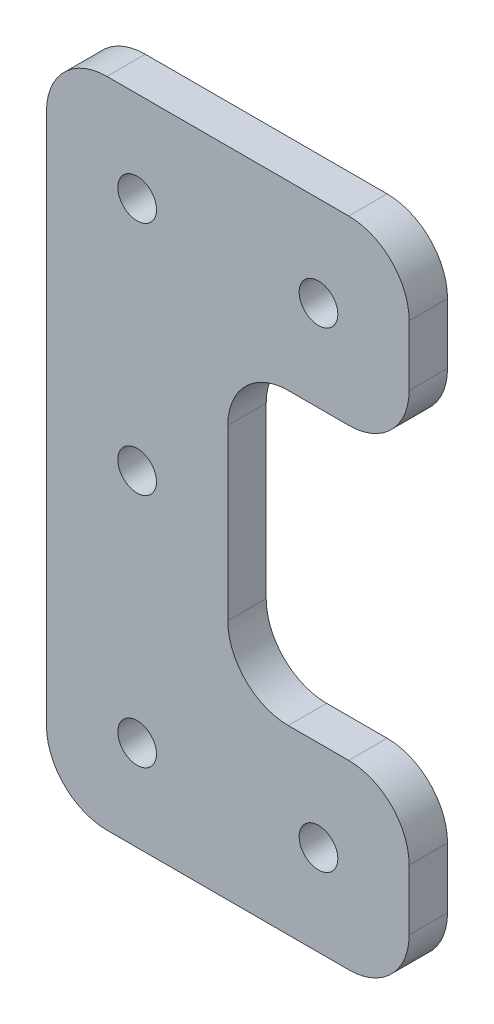
ISO-10303-21;
HEADER;
FILE_DESCRIPTION(('STEP AP214'),'2;1');
FILE_NAME('part.step','',(''),(''),'','','');
FILE_SCHEMA(('AUTOMOTIVE_DESIGN { 1 0 10303 214 1 1 1 1 }'));
ENDSEC;
DATA;
#1=APPLICATION_CONTEXT('core data for automotive mechanical design processes');
#2=APPLICATION_PROTOCOL_DEFINITION('international standard','automotive_design',2000,#1);
#3=PRODUCT_CONTEXT('',#1,'mechanical');
#4=PRODUCT('Part','Part','',(#3));
#5=PRODUCT_RELATED_PRODUCT_CATEGORY('part','',(#4));
#6=PRODUCT_DEFINITION_FORMATION('','',#4);
#7=PRODUCT_DEFINITION_CONTEXT('part definition',#1,'design');
#8=PRODUCT_DEFINITION('design','',#6,#7);
#9=PRODUCT_DEFINITION_SHAPE('','',#8);
#10=(LENGTH_UNIT() NAMED_UNIT(*) SI_UNIT(.MILLI.,.METRE.));
#11=(NAMED_UNIT(*) PLANE_ANGLE_UNIT() SI_UNIT($,.RADIAN.));
#12=(NAMED_UNIT(*) SI_UNIT($,.STERADIAN.) SOLID_ANGLE_UNIT());
#13=UNCERTAINTY_MEASURE_WITH_UNIT(LENGTH_MEASURE(1.E-05),#10,'distance_accuracy_value','');
#14=(GEOMETRIC_REPRESENTATION_CONTEXT(3) GLOBAL_UNCERTAINTY_ASSIGNED_CONTEXT((#13)) GLOBAL_UNIT_ASSIGNED_CONTEXT((#10,
#11,#12)) REPRESENTATION_CONTEXT('',''));
#15=CARTESIAN_POINT('',(0.,0.,0.));
#16=DIRECTION('',(0.,0.,1.));
#17=DIRECTION('',(1.,0.,0.));
#18=AXIS2_PLACEMENT_3D('',#15,#16,#17);
#19=CARTESIAN_POINT('',(15.,39.,3.175));
#20=DIRECTION('',(-1.,0.,0.));
#21=DIRECTION('',(0.,-1.,0.));
#22=AXIS2_PLACEMENT_3D('',#19,#20,#21);
#23=PLANE('',#22);
#24=DIRECTION('',(0.,1.,0.));
#25=VECTOR('',#24,1.);
#26=CARTESIAN_POINT('',(15.,39.,0.));
#27=LINE('',#26,#25);
#28=CARTESIAN_POINT('',(15.,20.,0.));
#29=VERTEX_POINT('',#28);
#30=CARTESIAN_POINT('',(15.,34.,0.));
#31=VERTEX_POINT('',#30);
#32=EDGE_CURVE('E243',#29,#31,#27,.T.);
#33=ORIENTED_EDGE('',*,*,#32,.T.);
#34=DIRECTION('',(0.,0.,-1.));
#35=VECTOR('',#34,1.);
#36=CARTESIAN_POINT('',(15.,34.,3.175));
#37=LINE('',#36,#35);
#38=CARTESIAN_POINT('',(15.,34.,3.175));
#39=VERTEX_POINT('',#38);
#40=EDGE_CURVE('E226',#31,#39,#37,.F.);
#41=ORIENTED_EDGE('',*,*,#40,.T.);
#42=DIRECTION('',(0.,1.,0.));
#43=VECTOR('',#42,1.);
#44=CARTESIAN_POINT('',(15.,39.,3.175));
#45=LINE('',#44,#43);
#46=CARTESIAN_POINT('',(15.,20.,3.175));
#47=VERTEX_POINT('',#46);
#48=EDGE_CURVE('E184',#47,#39,#45,.T.);
#49=ORIENTED_EDGE('',*,*,#48,.F.);
#50=DIRECTION('',(0.,0.,-1.));
#51=VECTOR('',#50,1.);
#52=CARTESIAN_POINT('',(15.,20.,0.));
#53=LINE('',#52,#51);
#54=EDGE_CURVE('E223',#47,#29,#53,.T.);
#55=ORIENTED_EDGE('',*,*,#54,.T.);
#56=EDGE_LOOP('',(#33,#41,#49,#55));
#57=FACE_BOUND('',#56,.T.);
#58=ADVANCED_FACE('F32',(#57),#23,.F.);
#59=CARTESIAN_POINT('',(15.,39.,3.175));
#60=DIRECTION('',(0.,1.,0.));
#61=DIRECTION('',(0.,0.,1.));
#62=AXIS2_PLACEMENT_3D('',#59,#60,#61);
#63=PLANE('',#62);
#64=DIRECTION('',(1.,0.,0.));
#65=VECTOR('',#64,1.);
#66=CARTESIAN_POINT('',(15.,39.,0.));
#67=LINE('',#66,#65);
#68=CARTESIAN_POINT('',(20.,39.,0.));
#69=VERTEX_POINT('',#68);
#70=CARTESIAN_POINT('',(25.,39.,0.));
#71=VERTEX_POINT('',#70);
#72=EDGE_CURVE('E277',#69,#71,#67,.T.);
#73=ORIENTED_EDGE('',*,*,#72,.T.);
#74=DIRECTION('',(0.,0.,-1.));
#75=VECTOR('',#74,1.);
#76=CARTESIAN_POINT('',(25.,39.,3.175));
#77=LINE('',#76,#75);
#78=CARTESIAN_POINT('',(25.,39.,3.175));
#79=VERTEX_POINT('',#78);
#80=EDGE_CURVE('E221',#71,#79,#77,.F.);
#81=ORIENTED_EDGE('',*,*,#80,.T.);
#82=DIRECTION('',(1.,0.,0.));
#83=VECTOR('',#82,1.);
#84=CARTESIAN_POINT('',(15.,39.,3.175));
#85=LINE('',#84,#83);
#86=CARTESIAN_POINT('',(20.,39.,3.175));
#87=VERTEX_POINT('',#86);
#88=EDGE_CURVE('E256',#87,#79,#85,.T.);
#89=ORIENTED_EDGE('',*,*,#88,.F.);
#90=DIRECTION('',(0.,0.,-1.));
#91=VECTOR('',#90,1.);
#92=CARTESIAN_POINT('',(20.,39.,0.));
#93=LINE('',#92,#91);
#94=EDGE_CURVE('E218',#87,#69,#93,.T.);
#95=ORIENTED_EDGE('',*,*,#94,.T.);
#96=EDGE_LOOP('',(#73,#81,#89,#95));
#97=FACE_BOUND('',#96,.T.);
#98=ADVANCED_FACE('F308',(#97),#63,.F.);
#99=CARTESIAN_POINT('',(30.,39.,3.175));
#100=DIRECTION('',(-1.,0.,0.));
#101=DIRECTION('',(0.,0.,1.));
#102=AXIS2_PLACEMENT_3D('',#99,#100,#101);
#103=PLANE('',#102);
#104=DIRECTION('',(0.,1.,0.));
#105=VECTOR('',#104,1.);
#106=CARTESIAN_POINT('',(30.,39.,0.));
#107=LINE('',#106,#105);
#108=CARTESIAN_POINT('',(30.,44.,0.));
#109=VERTEX_POINT('',#108);
#110=CARTESIAN_POINT('',(30.,49.,0.));
#111=VERTEX_POINT('',#110);
#112=EDGE_CURVE('E281',#109,#111,#107,.T.);
#113=ORIENTED_EDGE('',*,*,#112,.T.);
#114=DIRECTION('',(0.,0.,-1.));
#115=VECTOR('',#114,1.);
#116=CARTESIAN_POINT('',(30.,49.,3.175));
#117=LINE('',#116,#115);
#118=CARTESIAN_POINT('',(30.,49.,3.175));
#119=VERTEX_POINT('',#118);
#120=EDGE_CURVE('E216',#111,#119,#117,.F.);
#121=ORIENTED_EDGE('',*,*,#120,.T.);
#122=DIRECTION('',(0.,1.,0.));
#123=VECTOR('',#122,1.);
#124=CARTESIAN_POINT('',(30.,39.,3.175));
#125=LINE('',#124,#123);
#126=CARTESIAN_POINT('',(30.,44.,3.175));
#127=VERTEX_POINT('',#126);
#128=EDGE_CURVE('E259',#127,#119,#125,.T.);
#129=ORIENTED_EDGE('',*,*,#128,.F.);
#130=DIRECTION('',(0.,0.,-1.));
#131=VECTOR('',#130,1.);
#132=CARTESIAN_POINT('',(30.,44.,3.175));
#133=LINE('',#132,#131);
#134=EDGE_CURVE('E213',#127,#109,#133,.T.);
#135=ORIENTED_EDGE('',*,*,#134,.T.);
#136=EDGE_LOOP('',(#113,#121,#129,#135));
#137=FACE_BOUND('',#136,.T.);
#138=ADVANCED_FACE('F305',(#137),#103,.F.);
#139=CARTESIAN_POINT('',(0.,54.,3.175));
#140=DIRECTION('',(0.,-1.,0.));
#141=DIRECTION('',(1.,0.,0.));
#142=AXIS2_PLACEMENT_3D('',#139,#140,#141);
#143=PLANE('',#142);
#144=DIRECTION('',(-1.,0.,0.));
#145=VECTOR('',#144,1.);
#146=CARTESIAN_POINT('',(0.,54.,0.));
#147=LINE('',#146,#145);
#148=CARTESIAN_POINT('',(25.,54.,0.));
#149=VERTEX_POINT('',#148);
#150=CARTESIAN_POINT('',(5.,54.,0.));
#151=VERTEX_POINT('',#150);
#152=EDGE_CURVE('E179',#149,#151,#147,.T.);
#153=ORIENTED_EDGE('',*,*,#152,.T.);
#154=DIRECTION('',(0.,0.,-1.));
#155=VECTOR('',#154,1.);
#156=CARTESIAN_POINT('',(5.,54.,3.175));
#157=LINE('',#156,#155);
#158=CARTESIAN_POINT('',(5.,54.,3.175));
#159=VERTEX_POINT('',#158);
#160=EDGE_CURVE('E211',#151,#159,#157,.F.);
#161=ORIENTED_EDGE('',*,*,#160,.T.);
#162=DIRECTION('',(-1.,0.,0.));
#163=VECTOR('',#162,1.);
#164=CARTESIAN_POINT('',(0.,54.,3.175));
#165=LINE('',#164,#163);
#166=CARTESIAN_POINT('',(25.,54.,3.175));
#167=VERTEX_POINT('',#166);
#168=EDGE_CURVE('E267',#167,#159,#165,.T.);
#169=ORIENTED_EDGE('',*,*,#168,.F.);
#170=DIRECTION('',(0.,0.,-1.));
#171=VECTOR('',#170,1.);
#172=CARTESIAN_POINT('',(25.,54.,3.175));
#173=LINE('',#172,#171);
#174=EDGE_CURVE('E208',#167,#149,#173,.T.);
#175=ORIENTED_EDGE('',*,*,#174,.T.);
#176=EDGE_LOOP('',(#153,#161,#169,#175));
#177=FACE_BOUND('',#176,.T.);
#178=ADVANCED_FACE('F287',(#177),#143,.F.);
#179=CARTESIAN_POINT('',(0.,54.,3.175));
#180=DIRECTION('',(1.,0.,0.));
#181=DIRECTION('',(0.,1.,0.));
#182=AXIS2_PLACEMENT_3D('',#179,#180,#181);
#183=PLANE('',#182);
#184=DIRECTION('',(0.,-1.,0.));
#185=VECTOR('',#184,1.);
#186=CARTESIAN_POINT('',(0.,54.,0.));
#187=LINE('',#186,#185);
#188=CARTESIAN_POINT('',(0.,49.,0.));
#189=VERTEX_POINT('',#188);
#190=CARTESIAN_POINT('',(0.,5.,0.));
#191=VERTEX_POINT('',#190);
#192=EDGE_CURVE('E174',#189,#191,#187,.T.);
#193=ORIENTED_EDGE('',*,*,#192,.T.);
#194=DIRECTION('',(0.,0.,-1.));
#195=VECTOR('',#194,1.);
#196=CARTESIAN_POINT('',(0.,5.,3.175));
#197=LINE('',#196,#195);
#198=CARTESIAN_POINT('',(0.,5.,3.175));
#199=VERTEX_POINT('',#198);
#200=EDGE_CURVE('E151',#191,#199,#197,.F.);
#201=ORIENTED_EDGE('',*,*,#200,.T.);
#202=DIRECTION('',(0.,-1.,0.));
#203=VECTOR('',#202,1.);
#204=CARTESIAN_POINT('',(0.,54.,3.175));
#205=LINE('',#204,#203);
#206=CARTESIAN_POINT('',(0.,49.,3.175));
#207=VERTEX_POINT('',#206);
#208=EDGE_CURVE('E270',#207,#199,#205,.T.);
#209=ORIENTED_EDGE('',*,*,#208,.F.);
#210=DIRECTION('',(0.,0.,-1.));
#211=VECTOR('',#210,1.);
#212=CARTESIAN_POINT('',(0.,49.,3.175));
#213=LINE('',#212,#211);
#214=EDGE_CURVE('E156',#207,#189,#213,.T.);
#215=ORIENTED_EDGE('',*,*,#214,.T.);
#216=EDGE_LOOP('',(#193,#201,#209,#215));
#217=FACE_BOUND('',#216,.T.);
#218=ADVANCED_FACE('F296',(#217),#183,.F.);
#219=CARTESIAN_POINT('',(0.,0.,3.175));
#220=DIRECTION('',(0.,1.,0.));
#221=DIRECTION('',(0.,0.,1.));
#222=AXIS2_PLACEMENT_3D('',#219,#220,#221);
#223=PLANE('',#222);
#224=DIRECTION('',(1.,0.,0.));
#225=VECTOR('',#224,1.);
#226=CARTESIAN_POINT('',(0.,0.,3.175));
#227=LINE('',#226,#225);
#228=CARTESIAN_POINT('',(5.,0.,3.175));
#229=VERTEX_POINT('',#228);
#230=CARTESIAN_POINT('',(25.,0.,3.175));
#231=VERTEX_POINT('',#230);
#232=EDGE_CURVE('E166',#229,#231,#227,.T.);
#233=ORIENTED_EDGE('',*,*,#232,.F.);
#234=DIRECTION('',(0.,0.,-1.));
#235=VECTOR('',#234,1.);
#236=CARTESIAN_POINT('',(5.,0.,3.175));
#237=LINE('',#236,#235);
#238=CARTESIAN_POINT('',(5.,0.,0.));
#239=VERTEX_POINT('',#238);
#240=EDGE_CURVE('E150',#229,#239,#237,.T.);
#241=ORIENTED_EDGE('',*,*,#240,.T.);
#242=DIRECTION('',(1.,0.,0.));
#243=VECTOR('',#242,1.);
#244=CARTESIAN_POINT('',(0.,0.,0.));
#245=LINE('',#244,#243);
#246=CARTESIAN_POINT('',(25.,0.,0.));
#247=VERTEX_POINT('',#246);
#248=EDGE_CURVE('E163',#239,#247,#245,.T.);
#249=ORIENTED_EDGE('',*,*,#248,.T.);
#250=DIRECTION('',(0.,0.,-1.));
#251=VECTOR('',#250,1.);
#252=CARTESIAN_POINT('',(25.,0.,3.175));
#253=LINE('',#252,#251);
#254=EDGE_CURVE('E168',#247,#231,#253,.F.);
#255=ORIENTED_EDGE('',*,*,#254,.T.);
#256=EDGE_LOOP('',(#233,#241,#249,#255));
#257=FACE_BOUND('',#256,.T.);
#258=ADVANCED_FACE('F162',(#257),#223,.F.);
#259=CARTESIAN_POINT('',(30.,15.,3.175));
#260=DIRECTION('',(-1.,0.,0.));
#261=DIRECTION('',(0.,0.,1.));
#262=AXIS2_PLACEMENT_3D('',#259,#260,#261);
#263=PLANE('',#262);
#264=DIRECTION('',(0.,1.,0.));
#265=VECTOR('',#264,1.);
#266=CARTESIAN_POINT('',(30.,15.,3.175));
#267=LINE('',#266,#265);
#268=CARTESIAN_POINT('',(30.,5.,3.175));
#269=VERTEX_POINT('',#268);
#270=CARTESIAN_POINT('',(30.,10.,3.175));
#271=VERTEX_POINT('',#270);
#272=EDGE_CURVE('E273',#269,#271,#267,.T.);
#273=ORIENTED_EDGE('',*,*,#272,.F.);
#274=DIRECTION('',(0.,0.,-1.));
#275=VECTOR('',#274,1.);
#276=CARTESIAN_POINT('',(30.,5.,3.175));
#277=LINE('',#276,#275);
#278=CARTESIAN_POINT('',(30.,5.,0.));
#279=VERTEX_POINT('',#278);
#280=EDGE_CURVE('E230',#269,#279,#277,.T.);
#281=ORIENTED_EDGE('',*,*,#280,.T.);
#282=DIRECTION('',(0.,1.,0.));
#283=VECTOR('',#282,1.);
#284=CARTESIAN_POINT('',(30.,15.,0.));
#285=LINE('',#284,#283);
#286=CARTESIAN_POINT('',(30.,10.,0.));
#287=VERTEX_POINT('',#286);
#288=EDGE_CURVE('E173',#279,#287,#285,.T.);
#289=ORIENTED_EDGE('',*,*,#288,.T.);
#290=DIRECTION('',(0.,0.,-1.));
#291=VECTOR('',#290,1.);
#292=CARTESIAN_POINT('',(30.,10.,3.175));
#293=LINE('',#292,#291);
#294=EDGE_CURVE('E228',#287,#271,#293,.F.);
#295=ORIENTED_EDGE('',*,*,#294,.T.);
#296=EDGE_LOOP('',(#273,#281,#289,#295));
#297=FACE_BOUND('',#296,.T.);
#298=ADVANCED_FACE('F303',(#297),#263,.F.);
#299=CARTESIAN_POINT('',(15.,15.,3.175));
#300=DIRECTION('',(0.,-1.,0.));
#301=DIRECTION('',(0.,0.,-1.));
#302=AXIS2_PLACEMENT_3D('',#299,#300,#301);
#303=PLANE('',#302);
#304=DIRECTION('',(-1.,0.,0.));
#305=VECTOR('',#304,1.);
#306=CARTESIAN_POINT('',(15.,15.,3.175));
#307=LINE('',#306,#305);
#308=CARTESIAN_POINT('',(25.,15.,3.175));
#309=VERTEX_POINT('',#308);
#310=CARTESIAN_POINT('',(20.,15.,3.175));
#311=VERTEX_POINT('',#310);
#312=EDGE_CURVE('E185',#309,#311,#307,.T.);
#313=ORIENTED_EDGE('',*,*,#312,.F.);
#314=DIRECTION('',(0.,0.,-1.));
#315=VECTOR('',#314,1.);
#316=CARTESIAN_POINT('',(25.,15.,3.175));
#317=LINE('',#316,#315);
#318=CARTESIAN_POINT('',(25.,15.,0.));
#319=VERTEX_POINT('',#318);
#320=EDGE_CURVE('E234',#309,#319,#317,.T.);
#321=ORIENTED_EDGE('',*,*,#320,.T.);
#322=DIRECTION('',(-1.,0.,0.));
#323=VECTOR('',#322,1.);
#324=CARTESIAN_POINT('',(15.,15.,0.));
#325=LINE('',#324,#323);
#326=CARTESIAN_POINT('',(20.,15.,0.));
#327=VERTEX_POINT('',#326);
#328=EDGE_CURVE('E177',#319,#327,#325,.T.);
#329=ORIENTED_EDGE('',*,*,#328,.T.);
#330=DIRECTION('',(0.,0.,-1.));
#331=VECTOR('',#330,1.);
#332=CARTESIAN_POINT('',(20.,15.,3.175));
#333=LINE('',#332,#331);
#334=EDGE_CURVE('E47',#327,#311,#333,.F.);
#335=ORIENTED_EDGE('',*,*,#334,.T.);
#336=EDGE_LOOP('',(#313,#321,#329,#335));
#337=FACE_BOUND('',#336,.T.);
#338=ADVANCED_FACE('F246',(#337),#303,.F.);
#339=CARTESIAN_POINT('',(0.,0.,3.175));
#340=DIRECTION('',(0.,0.,1.));
#341=DIRECTION('',(1.,0.,0.));
#342=AXIS2_PLACEMENT_3D('',#339,#340,#341);
#343=PLANE('',#342);
#344=CARTESIAN_POINT('',(22.5,46.5,3.175));
#345=DIRECTION('',(0.,0.,1.));
#346=DIRECTION('',(1.,0.,0.));
#347=AXIS2_PLACEMENT_3D('',#344,#345,#346);
#348=CIRCLE('',#347,1.6);
#349=CARTESIAN_POINT('',(24.1,46.5,3.175));
#350=VERTEX_POINT('',#349);
#351=EDGE_CURVE('E387',#350,#350,#348,.T.);
#352=ORIENTED_EDGE('',*,*,#351,.F.);
#353=EDGE_LOOP('',(#352));
#354=FACE_BOUND('',#353,.T.);
#355=CARTESIAN_POINT('',(7.5,27.,3.175));
#356=DIRECTION('',(0.,0.,1.));
#357=DIRECTION('',(1.,0.,0.));
#358=AXIS2_PLACEMENT_3D('',#355,#356,#357);
#359=CIRCLE('',#358,1.6);
#360=CARTESIAN_POINT('',(9.1,27.,3.175));
#361=VERTEX_POINT('',#360);
#362=EDGE_CURVE('E389',#361,#361,#359,.T.);
#363=ORIENTED_EDGE('',*,*,#362,.F.);
#364=EDGE_LOOP('',(#363));
#365=FACE_BOUND('',#364,.T.);
#366=CARTESIAN_POINT('',(22.5,7.5,3.175));
#367=DIRECTION('',(0.,0.,1.));
#368=DIRECTION('',(1.,0.,0.));
#369=AXIS2_PLACEMENT_3D('',#366,#367,#368);
#370=CIRCLE('',#369,1.60000000000001);
#371=CARTESIAN_POINT('',(24.1,7.5,3.175));
#372=VERTEX_POINT('',#371);
#373=EDGE_CURVE('E395',#372,#372,#370,.T.);
#374=ORIENTED_EDGE('',*,*,#373,.F.);
#375=EDGE_LOOP('',(#374));
#376=FACE_BOUND('',#375,.T.);
#377=CARTESIAN_POINT('',(7.5,46.5,3.175));
#378=DIRECTION('',(0.,0.,1.));
#379=DIRECTION('',(1.,0.,0.));
#380=AXIS2_PLACEMENT_3D('',#377,#378,#379);
#381=CIRCLE('',#380,1.6);
#382=CARTESIAN_POINT('',(9.1,46.5,3.175));
#383=VERTEX_POINT('',#382);
#384=EDGE_CURVE('E401',#383,#383,#381,.T.);
#385=ORIENTED_EDGE('',*,*,#384,.F.);
#386=EDGE_LOOP('',(#385));
#387=FACE_BOUND('',#386,.T.);
#388=CARTESIAN_POINT('',(7.5,7.5,3.175));
#389=DIRECTION('',(0.,0.,1.));
#390=DIRECTION('',(1.,0.,0.));
#391=AXIS2_PLACEMENT_3D('',#388,#389,#390);
#392=CIRCLE('',#391,1.6);
#393=CARTESIAN_POINT('',(9.1,7.5,3.175));
#394=VERTEX_POINT('',#393);
#395=EDGE_CURVE('E262',#394,#394,#392,.T.);
#396=ORIENTED_EDGE('',*,*,#395,.F.);
#397=EDGE_LOOP('',(#396));
#398=FACE_BOUND('',#397,.T.);
#399=ORIENTED_EDGE('',*,*,#208,.T.);
#400=CARTESIAN_POINT('',(5.,5.,3.175));
#401=DIRECTION('',(0.,0.,1.));
#402=DIRECTION('',(1.,0.,0.));
#403=AXIS2_PLACEMENT_3D('',#400,#401,#402);
#404=CIRCLE('',#403,5.);
#405=EDGE_CURVE('E206',#199,#229,#404,.T.);
#406=ORIENTED_EDGE('',*,*,#405,.T.);
#407=ORIENTED_EDGE('',*,*,#232,.T.);
#408=CARTESIAN_POINT('',(25.,5.,3.175));
#409=DIRECTION('',(0.,0.,1.));
#410=DIRECTION('',(1.,0.,0.));
#411=AXIS2_PLACEMENT_3D('',#408,#409,#410);
#412=CIRCLE('',#411,5.);
#413=EDGE_CURVE('E198',#231,#269,#412,.T.);
#414=ORIENTED_EDGE('',*,*,#413,.T.);
#415=ORIENTED_EDGE('',*,*,#272,.T.);
#416=CARTESIAN_POINT('',(25.,10.,3.175));
#417=DIRECTION('',(0.,0.,1.));
#418=DIRECTION('',(1.,0.,0.));
#419=AXIS2_PLACEMENT_3D('',#416,#417,#418);
#420=CIRCLE('',#419,5.);
#421=EDGE_CURVE('E54',#271,#309,#420,.T.);
#422=ORIENTED_EDGE('',*,*,#421,.T.);
#423=ORIENTED_EDGE('',*,*,#312,.T.);
#424=CARTESIAN_POINT('',(20.,20.,3.175));
#425=DIRECTION('',(0.,0.,1.));
#426=DIRECTION('',(1.,0.,0.));
#427=AXIS2_PLACEMENT_3D('',#424,#425,#426);
#428=CIRCLE('',#427,5.);
#429=EDGE_CURVE('E11',#311,#47,#428,.F.);
#430=ORIENTED_EDGE('',*,*,#429,.T.);
#431=ORIENTED_EDGE('',*,*,#48,.T.);
#432=CARTESIAN_POINT('',(20.,34.,3.175));
#433=DIRECTION('',(0.,0.,1.));
#434=DIRECTION('',(1.,0.,0.));
#435=AXIS2_PLACEMENT_3D('',#432,#433,#434);
#436=CIRCLE('',#435,5.);
#437=EDGE_CURVE('E239',#39,#87,#436,.F.);
#438=ORIENTED_EDGE('',*,*,#437,.T.);
#439=ORIENTED_EDGE('',*,*,#88,.T.);
#440=CARTESIAN_POINT('',(25.,44.,3.175));
#441=DIRECTION('',(0.,0.,1.));
#442=DIRECTION('',(1.,0.,0.));
#443=AXIS2_PLACEMENT_3D('',#440,#441,#442);
#444=CIRCLE('',#443,5.);
#445=EDGE_CURVE('E200',#79,#127,#444,.T.);
#446=ORIENTED_EDGE('',*,*,#445,.T.);
#447=ORIENTED_EDGE('',*,*,#128,.T.);
#448=CARTESIAN_POINT('',(25.,49.,3.175));
#449=DIRECTION('',(0.,0.,1.));
#450=DIRECTION('',(1.,0.,0.));
#451=AXIS2_PLACEMENT_3D('',#448,#449,#450);
#452=CIRCLE('',#451,5.);
#453=EDGE_CURVE('E202',#119,#167,#452,.T.);
#454=ORIENTED_EDGE('',*,*,#453,.T.);
#455=ORIENTED_EDGE('',*,*,#168,.T.);
#456=CARTESIAN_POINT('',(5.,49.,3.175));
#457=DIRECTION('',(0.,0.,1.));
#458=DIRECTION('',(1.,0.,0.));
#459=AXIS2_PLACEMENT_3D('',#456,#457,#458);
#460=CIRCLE('',#459,5.);
#461=EDGE_CURVE('E204',#159,#207,#460,.T.);
#462=ORIENTED_EDGE('',*,*,#461,.T.);
#463=EDGE_LOOP('',(#399,#406,#407,#414,#415,#422,#423,#430,#431,#438,#439,#446,#447,#454,#455,#462));
#464=FACE_BOUND('',#463,.T.);
#465=ADVANCED_FACE('F252',(#354,#365,#376,#387,#398,#464),#343,.T.);
#466=CARTESIAN_POINT('',(0.,0.,0.));
#467=DIRECTION('',(0.,0.,1.));
#468=DIRECTION('',(1.,0.,0.));
#469=AXIS2_PLACEMENT_3D('',#466,#467,#468);
#470=PLANE('',#469);
#471=CARTESIAN_POINT('',(22.5,46.5,0.));
#472=DIRECTION('',(0.,0.,1.));
#473=DIRECTION('',(1.,0.,0.));
#474=AXIS2_PLACEMENT_3D('',#471,#472,#473);
#475=CIRCLE('',#474,1.6);
#476=CARTESIAN_POINT('',(24.1,46.5,0.));
#477=VERTEX_POINT('',#476);
#478=EDGE_CURVE('E384',#477,#477,#475,.T.);
#479=ORIENTED_EDGE('',*,*,#478,.T.);
#480=EDGE_LOOP('',(#479));
#481=FACE_BOUND('',#480,.T.);
#482=CARTESIAN_POINT('',(7.5,27.,0.));
#483=DIRECTION('',(0.,0.,1.));
#484=DIRECTION('',(1.,0.,0.));
#485=AXIS2_PLACEMENT_3D('',#482,#483,#484);
#486=CIRCLE('',#485,1.6);
#487=CARTESIAN_POINT('',(9.1,27.,0.));
#488=VERTEX_POINT('',#487);
#489=EDGE_CURVE('E392',#488,#488,#486,.T.);
#490=ORIENTED_EDGE('',*,*,#489,.T.);
#491=EDGE_LOOP('',(#490));
#492=FACE_BOUND('',#491,.T.);
#493=CARTESIAN_POINT('',(22.5,7.5,0.));
#494=DIRECTION('',(0.,0.,1.));
#495=DIRECTION('',(1.,0.,0.));
#496=AXIS2_PLACEMENT_3D('',#493,#494,#495);
#497=CIRCLE('',#496,1.60000000000001);
#498=CARTESIAN_POINT('',(24.1,7.5,0.));
#499=VERTEX_POINT('',#498);
#500=EDGE_CURVE('E398',#499,#499,#497,.T.);
#501=ORIENTED_EDGE('',*,*,#500,.T.);
#502=EDGE_LOOP('',(#501));
#503=FACE_BOUND('',#502,.T.);
#504=CARTESIAN_POINT('',(7.5,46.5,0.));
#505=DIRECTION('',(0.,0.,1.));
#506=DIRECTION('',(1.,0.,0.));
#507=AXIS2_PLACEMENT_3D('',#504,#505,#506);
#508=CIRCLE('',#507,1.6);
#509=CARTESIAN_POINT('',(9.1,46.5,0.));
#510=VERTEX_POINT('',#509);
#511=EDGE_CURVE('E404',#510,#510,#508,.T.);
#512=ORIENTED_EDGE('',*,*,#511,.T.);
#513=EDGE_LOOP('',(#512));
#514=FACE_BOUND('',#513,.T.);
#515=CARTESIAN_POINT('',(7.5,7.5,0.));
#516=DIRECTION('',(0.,0.,1.));
#517=DIRECTION('',(1.,0.,0.));
#518=AXIS2_PLACEMENT_3D('',#515,#516,#517);
#519=CIRCLE('',#518,1.6);
#520=CARTESIAN_POINT('',(9.1,7.5,0.));
#521=VERTEX_POINT('',#520);
#522=EDGE_CURVE('E278',#521,#521,#519,.T.);
#523=ORIENTED_EDGE('',*,*,#522,.T.);
#524=EDGE_LOOP('',(#523));
#525=FACE_BOUND('',#524,.T.);
#526=ORIENTED_EDGE('',*,*,#248,.F.);
#527=CARTESIAN_POINT('',(5.,5.,0.));
#528=DIRECTION('',(0.,0.,1.));
#529=DIRECTION('',(1.,0.,0.));
#530=AXIS2_PLACEMENT_3D('',#527,#528,#529);
#531=CIRCLE('',#530,5.);
#532=EDGE_CURVE('E146',#239,#191,#531,.F.);
#533=ORIENTED_EDGE('',*,*,#532,.T.);
#534=ORIENTED_EDGE('',*,*,#192,.F.);
#535=CARTESIAN_POINT('',(5.,49.,0.));
#536=DIRECTION('',(0.,0.,1.));
#537=DIRECTION('',(1.,0.,0.));
#538=AXIS2_PLACEMENT_3D('',#535,#536,#537);
#539=CIRCLE('',#538,5.);
#540=EDGE_CURVE('E157',#189,#151,#539,.F.);
#541=ORIENTED_EDGE('',*,*,#540,.T.);
#542=ORIENTED_EDGE('',*,*,#152,.F.);
#543=CARTESIAN_POINT('',(25.,49.,0.));
#544=DIRECTION('',(0.,0.,1.));
#545=DIRECTION('',(1.,0.,0.));
#546=AXIS2_PLACEMENT_3D('',#543,#544,#545);
#547=CIRCLE('',#546,5.);
#548=EDGE_CURVE('E191',#149,#111,#547,.F.);
#549=ORIENTED_EDGE('',*,*,#548,.T.);
#550=ORIENTED_EDGE('',*,*,#112,.F.);
#551=CARTESIAN_POINT('',(25.,44.,0.));
#552=DIRECTION('',(0.,0.,1.));
#553=DIRECTION('',(1.,0.,0.));
#554=AXIS2_PLACEMENT_3D('',#551,#552,#553);
#555=CIRCLE('',#554,5.);
#556=EDGE_CURVE('E189',#109,#71,#555,.F.);
#557=ORIENTED_EDGE('',*,*,#556,.T.);
#558=ORIENTED_EDGE('',*,*,#72,.F.);
#559=CARTESIAN_POINT('',(20.,34.,0.));
#560=DIRECTION('',(0.,0.,1.));
#561=DIRECTION('',(1.,0.,0.));
#562=AXIS2_PLACEMENT_3D('',#559,#560,#561);
#563=CIRCLE('',#562,5.);
#564=EDGE_CURVE('E237',#69,#31,#563,.T.);
#565=ORIENTED_EDGE('',*,*,#564,.T.);
#566=ORIENTED_EDGE('',*,*,#32,.F.);
#567=CARTESIAN_POINT('',(20.,20.,0.));
#568=DIRECTION('',(0.,0.,1.));
#569=DIRECTION('',(1.,0.,0.));
#570=AXIS2_PLACEMENT_3D('',#567,#568,#569);
#571=CIRCLE('',#570,5.);
#572=EDGE_CURVE('E40',#29,#327,#571,.T.);
#573=ORIENTED_EDGE('',*,*,#572,.T.);
#574=ORIENTED_EDGE('',*,*,#328,.F.);
#575=CARTESIAN_POINT('',(25.,10.,0.));
#576=DIRECTION('',(0.,0.,1.));
#577=DIRECTION('',(1.,0.,0.));
#578=AXIS2_PLACEMENT_3D('',#575,#576,#577);
#579=CIRCLE('',#578,5.);
#580=EDGE_CURVE('E167',#319,#287,#579,.F.);
#581=ORIENTED_EDGE('',*,*,#580,.T.);
#582=ORIENTED_EDGE('',*,*,#288,.F.);
#583=CARTESIAN_POINT('',(25.,5.,0.));
#584=DIRECTION('',(0.,0.,1.));
#585=DIRECTION('',(1.,0.,0.));
#586=AXIS2_PLACEMENT_3D('',#583,#584,#585);
#587=CIRCLE('',#586,5.);
#588=EDGE_CURVE('E172',#279,#247,#587,.F.);
#589=ORIENTED_EDGE('',*,*,#588,.T.);
#590=EDGE_LOOP('',(#526,#533,#534,#541,#542,#549,#550,#557,#558,#565,#566,#573,#574,#581,#582,#589));
#591=FACE_BOUND('',#590,.T.);
#592=ADVANCED_FACE('F170',(#481,#492,#503,#514,#525,#591),#470,.F.);
#593=CARTESIAN_POINT('',(5.,5.,3.175));
#594=DIRECTION('',(0.,0.,-1.));
#595=DIRECTION('',(-1.,0.,0.));
#596=AXIS2_PLACEMENT_3D('',#593,#594,#595);
#597=CYLINDRICAL_SURFACE('',#596,5.);
#598=ORIENTED_EDGE('',*,*,#405,.F.);
#599=ORIENTED_EDGE('',*,*,#200,.F.);
#600=ORIENTED_EDGE('',*,*,#532,.F.);
#601=ORIENTED_EDGE('',*,*,#240,.F.);
#602=EDGE_LOOP('',(#598,#599,#600,#601));
#603=FACE_BOUND('',#602,.T.);
#604=ADVANCED_FACE('F149',(#603),#597,.T.);
#605=CARTESIAN_POINT('',(5.,49.,3.175));
#606=DIRECTION('',(0.,0.,-1.));
#607=DIRECTION('',(-1.,0.,0.));
#608=AXIS2_PLACEMENT_3D('',#605,#606,#607);
#609=CYLINDRICAL_SURFACE('',#608,5.);
#610=ORIENTED_EDGE('',*,*,#461,.F.);
#611=ORIENTED_EDGE('',*,*,#160,.F.);
#612=ORIENTED_EDGE('',*,*,#540,.F.);
#613=ORIENTED_EDGE('',*,*,#214,.F.);
#614=EDGE_LOOP('',(#610,#611,#612,#613));
#615=FACE_BOUND('',#614,.T.);
#616=ADVANCED_FACE('F292',(#615),#609,.T.);
#617=CARTESIAN_POINT('',(25.,49.,3.175));
#618=DIRECTION('',(0.,0.,-1.));
#619=DIRECTION('',(-1.,0.,0.));
#620=AXIS2_PLACEMENT_3D('',#617,#618,#619);
#621=CYLINDRICAL_SURFACE('',#620,5.);
#622=ORIENTED_EDGE('',*,*,#453,.F.);
#623=ORIENTED_EDGE('',*,*,#120,.F.);
#624=ORIENTED_EDGE('',*,*,#548,.F.);
#625=ORIENTED_EDGE('',*,*,#174,.F.);
#626=EDGE_LOOP('',(#622,#623,#624,#625));
#627=FACE_BOUND('',#626,.T.);
#628=ADVANCED_FACE('F321',(#627),#621,.T.);
#629=CARTESIAN_POINT('',(25.,44.,3.175));
#630=DIRECTION('',(0.,0.,-1.));
#631=DIRECTION('',(-1.,0.,0.));
#632=AXIS2_PLACEMENT_3D('',#629,#630,#631);
#633=CYLINDRICAL_SURFACE('',#632,5.);
#634=ORIENTED_EDGE('',*,*,#445,.F.);
#635=ORIENTED_EDGE('',*,*,#80,.F.);
#636=ORIENTED_EDGE('',*,*,#556,.F.);
#637=ORIENTED_EDGE('',*,*,#134,.F.);
#638=EDGE_LOOP('',(#634,#635,#636,#637));
#639=FACE_BOUND('',#638,.T.);
#640=ADVANCED_FACE('F324',(#639),#633,.T.);
#641=CARTESIAN_POINT('',(20.,34.,3.175));
#642=DIRECTION('',(0.,0.,1.));
#643=DIRECTION('',(1.,0.,0.));
#644=AXIS2_PLACEMENT_3D('',#641,#642,#643);
#645=CYLINDRICAL_SURFACE('',#644,5.);
#646=ORIENTED_EDGE('',*,*,#437,.F.);
#647=ORIENTED_EDGE('',*,*,#40,.F.);
#648=ORIENTED_EDGE('',*,*,#564,.F.);
#649=ORIENTED_EDGE('',*,*,#94,.F.);
#650=EDGE_LOOP('',(#646,#647,#648,#649));
#651=FACE_BOUND('',#650,.T.);
#652=ADVANCED_FACE('F328',(#651),#645,.F.);
#653=CARTESIAN_POINT('',(25.,5.,3.175));
#654=DIRECTION('',(0.,0.,-1.));
#655=DIRECTION('',(-1.,0.,0.));
#656=AXIS2_PLACEMENT_3D('',#653,#654,#655);
#657=CYLINDRICAL_SURFACE('',#656,5.);
#658=ORIENTED_EDGE('',*,*,#413,.F.);
#659=ORIENTED_EDGE('',*,*,#254,.F.);
#660=ORIENTED_EDGE('',*,*,#588,.F.);
#661=ORIENTED_EDGE('',*,*,#280,.F.);
#662=EDGE_LOOP('',(#658,#659,#660,#661));
#663=FACE_BOUND('',#662,.T.);
#664=ADVANCED_FACE('F332',(#663),#657,.T.);
#665=CARTESIAN_POINT('',(25.,10.,3.175));
#666=DIRECTION('',(0.,0.,-1.));
#667=DIRECTION('',(-1.,0.,0.));
#668=AXIS2_PLACEMENT_3D('',#665,#666,#667);
#669=CYLINDRICAL_SURFACE('',#668,5.);
#670=ORIENTED_EDGE('',*,*,#421,.F.);
#671=ORIENTED_EDGE('',*,*,#294,.F.);
#672=ORIENTED_EDGE('',*,*,#580,.F.);
#673=ORIENTED_EDGE('',*,*,#320,.F.);
#674=EDGE_LOOP('',(#670,#671,#672,#673));
#675=FACE_BOUND('',#674,.T.);
#676=ADVANCED_FACE('F335',(#675),#669,.T.);
#677=CARTESIAN_POINT('',(20.,20.,3.175));
#678=DIRECTION('',(0.,0.,1.));
#679=DIRECTION('',(1.,0.,0.));
#680=AXIS2_PLACEMENT_3D('',#677,#678,#679);
#681=CYLINDRICAL_SURFACE('',#680,5.);
#682=ORIENTED_EDGE('',*,*,#429,.F.);
#683=ORIENTED_EDGE('',*,*,#334,.F.);
#684=ORIENTED_EDGE('',*,*,#572,.F.);
#685=ORIENTED_EDGE('',*,*,#54,.F.);
#686=EDGE_LOOP('',(#682,#683,#684,#685));
#687=FACE_BOUND('',#686,.T.);
#688=ADVANCED_FACE('F34',(#687),#681,.F.);
#689=CARTESIAN_POINT('',(7.5,7.5,0.));
#690=DIRECTION('',(0.,0.,1.));
#691=DIRECTION('',(1.,0.,0.));
#692=AXIS2_PLACEMENT_3D('',#689,#690,#691);
#693=CYLINDRICAL_SURFACE('',#692,1.6);
#694=ORIENTED_EDGE('',*,*,#522,.F.);
#695=EDGE_LOOP('',(#694));
#696=FACE_BOUND('',#695,.T.);
#697=ORIENTED_EDGE('',*,*,#395,.T.);
#698=EDGE_LOOP('',(#697));
#699=FACE_BOUND('',#698,.T.);
#700=ADVANCED_FACE('F342',(#696,#699),#693,.F.);
#701=CARTESIAN_POINT('',(7.5,46.5,0.));
#702=DIRECTION('',(0.,0.,1.));
#703=DIRECTION('',(1.,0.,0.));
#704=AXIS2_PLACEMENT_3D('',#701,#702,#703);
#705=CYLINDRICAL_SURFACE('',#704,1.6);
#706=ORIENTED_EDGE('',*,*,#511,.F.);
#707=EDGE_LOOP('',(#706));
#708=FACE_BOUND('',#707,.T.);
#709=ORIENTED_EDGE('',*,*,#384,.T.);
#710=EDGE_LOOP('',(#709));
#711=FACE_BOUND('',#710,.T.);
#712=ADVANCED_FACE('F363',(#708,#711),#705,.F.);
#713=CARTESIAN_POINT('',(22.5,7.5,0.));
#714=DIRECTION('',(0.,0.,1.));
#715=DIRECTION('',(1.,0.,0.));
#716=AXIS2_PLACEMENT_3D('',#713,#714,#715);
#717=CYLINDRICAL_SURFACE('',#716,1.60000000000001);
#718=ORIENTED_EDGE('',*,*,#500,.F.);
#719=EDGE_LOOP('',(#718));
#720=FACE_BOUND('',#719,.T.);
#721=ORIENTED_EDGE('',*,*,#373,.T.);
#722=EDGE_LOOP('',(#721));
#723=FACE_BOUND('',#722,.T.);
#724=ADVANCED_FACE('F367',(#720,#723),#717,.F.);
#725=CARTESIAN_POINT('',(7.5,27.,0.));
#726=DIRECTION('',(0.,0.,1.));
#727=DIRECTION('',(1.,0.,0.));
#728=AXIS2_PLACEMENT_3D('',#725,#726,#727);
#729=CYLINDRICAL_SURFACE('',#728,1.6);
#730=ORIENTED_EDGE('',*,*,#489,.F.);
#731=EDGE_LOOP('',(#730));
#732=FACE_BOUND('',#731,.T.);
#733=ORIENTED_EDGE('',*,*,#362,.T.);
#734=EDGE_LOOP('',(#733));
#735=FACE_BOUND('',#734,.T.);
#736=ADVANCED_FACE('F371',(#732,#735),#729,.F.);
#737=CARTESIAN_POINT('',(22.5,46.5,0.));
#738=DIRECTION('',(0.,0.,1.));
#739=DIRECTION('',(1.,0.,0.));
#740=AXIS2_PLACEMENT_3D('',#737,#738,#739);
#741=CYLINDRICAL_SURFACE('',#740,1.6);
#742=ORIENTED_EDGE('',*,*,#478,.F.);
#743=EDGE_LOOP('',(#742));
#744=FACE_BOUND('',#743,.T.);
#745=ORIENTED_EDGE('',*,*,#351,.T.);
#746=EDGE_LOOP('',(#745));
#747=FACE_BOUND('',#746,.T.);
#748=ADVANCED_FACE('F375',(#744,#747),#741,.F.);
#749=CLOSED_SHELL('',(#58,#98,#138,#178,#218,#258,#298,#338,#465,#592,#604,#616,#628,#640,#652,
#664,#676,#688,#700,#712,#724,#736,#748));
#750=MANIFOLD_SOLID_BREP('B2',#749);
#751=ADVANCED_BREP_SHAPE_REPRESENTATION('',(#18,#750),#14);
#752=SHAPE_DEFINITION_REPRESENTATION(#9,#751);
ENDSEC;
END-ISO-10303-21;
